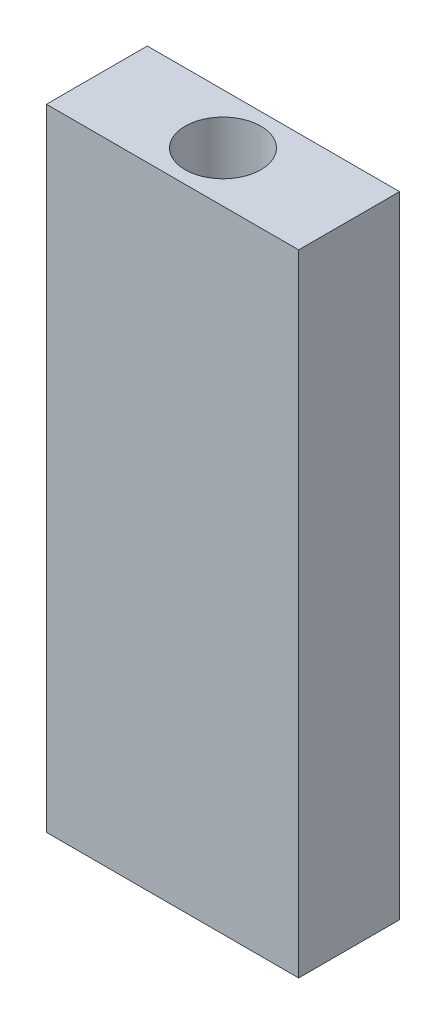
ISO-10303-21;
HEADER;
FILE_DESCRIPTION(('STEP AP214'),'2;1');
FILE_NAME('part.step','',(''),(''),'','','');
FILE_SCHEMA(('AUTOMOTIVE_DESIGN { 1 0 10303 214 1 1 1 1 }'));
ENDSEC;
DATA;
#1=APPLICATION_CONTEXT('core data for automotive mechanical design processes');
#2=APPLICATION_PROTOCOL_DEFINITION('international standard','automotive_design',2000,#1);
#3=PRODUCT_CONTEXT('',#1,'mechanical');
#4=PRODUCT('Part','Part','',(#3));
#5=PRODUCT_RELATED_PRODUCT_CATEGORY('part','',(#4));
#6=PRODUCT_DEFINITION_FORMATION('','',#4);
#7=PRODUCT_DEFINITION_CONTEXT('part definition',#1,'design');
#8=PRODUCT_DEFINITION('design','',#6,#7);
#9=PRODUCT_DEFINITION_SHAPE('','',#8);
#10=(LENGTH_UNIT() NAMED_UNIT(*) SI_UNIT(.MILLI.,.METRE.));
#11=(NAMED_UNIT(*) PLANE_ANGLE_UNIT() SI_UNIT($,.RADIAN.));
#12=(NAMED_UNIT(*) SI_UNIT($,.STERADIAN.) SOLID_ANGLE_UNIT());
#13=UNCERTAINTY_MEASURE_WITH_UNIT(LENGTH_MEASURE(1.E-05),#10,'distance_accuracy_value','');
#14=(GEOMETRIC_REPRESENTATION_CONTEXT(3) GLOBAL_UNCERTAINTY_ASSIGNED_CONTEXT((#13)) GLOBAL_UNIT_ASSIGNED_CONTEXT((#10,
#11,#12)) REPRESENTATION_CONTEXT('',''));
#15=CARTESIAN_POINT('',(0.,0.,0.));
#16=DIRECTION('',(0.,0.,1.));
#17=DIRECTION('',(1.,0.,0.));
#18=AXIS2_PLACEMENT_3D('',#15,#16,#17);
#19=CARTESIAN_POINT('',(0.,25.,0.));
#20=DIRECTION('',(0.,1.,0.));
#21=DIRECTION('',(0.,0.,1.));
#22=AXIS2_PLACEMENT_3D('',#19,#20,#21);
#23=PLANE('',#22);
#24=DIRECTION('',(0.,0.,1.));
#25=VECTOR('',#24,1.);
#26=CARTESIAN_POINT('',(-5.,25.,-2.));
#27=LINE('',#26,#25);
#28=CARTESIAN_POINT('',(-5.,25.,-2.));
#29=VERTEX_POINT('',#28);
#30=CARTESIAN_POINT('',(-5.,25.,2.));
#31=VERTEX_POINT('',#30);
#32=EDGE_CURVE('E109',#29,#31,#27,.T.);
#33=ORIENTED_EDGE('',*,*,#32,.T.);
#34=DIRECTION('',(1.,0.,0.));
#35=VECTOR('',#34,1.);
#36=CARTESIAN_POINT('',(-5.,25.,2.));
#37=LINE('',#36,#35);
#38=CARTESIAN_POINT('',(5.,25.,2.));
#39=VERTEX_POINT('',#38);
#40=EDGE_CURVE('E104',#31,#39,#37,.T.);
#41=ORIENTED_EDGE('',*,*,#40,.T.);
#42=DIRECTION('',(0.,0.,-1.));
#43=VECTOR('',#42,1.);
#44=CARTESIAN_POINT('',(5.,25.,-2.));
#45=LINE('',#44,#43);
#46=CARTESIAN_POINT('',(5.,25.,-2.));
#47=VERTEX_POINT('',#46);
#48=EDGE_CURVE('E107',#39,#47,#45,.T.);
#49=ORIENTED_EDGE('',*,*,#48,.T.);
#50=DIRECTION('',(-1.,0.,0.));
#51=VECTOR('',#50,1.);
#52=CARTESIAN_POINT('',(-5.,25.,-2.));
#53=LINE('',#52,#51);
#54=EDGE_CURVE('E68',#47,#29,#53,.T.);
#55=ORIENTED_EDGE('',*,*,#54,.T.);
#56=EDGE_LOOP('',(#33,#41,#49,#55));
#57=FACE_BOUND('',#56,.T.);
#58=CARTESIAN_POINT('',(0.,25.,0.));
#59=DIRECTION('',(0.,1.,0.));
#60=DIRECTION('',(0.,0.,1.));
#61=AXIS2_PLACEMENT_3D('',#58,#59,#60);
#62=CIRCLE('',#61,1.5);
#63=CARTESIAN_POINT('',(0.,25.,1.5));
#64=VERTEX_POINT('',#63);
#65=EDGE_CURVE('E130',#64,#64,#62,.T.);
#66=ORIENTED_EDGE('',*,*,#65,.F.);
#67=EDGE_LOOP('',(#66));
#68=FACE_BOUND('',#67,.T.);
#69=ADVANCED_FACE('F48',(#57,#68),#23,.T.);
#70=CARTESIAN_POINT('',(0.,0.,0.));
#71=DIRECTION('',(0.,1.,0.));
#72=DIRECTION('',(0.,0.,1.));
#73=AXIS2_PLACEMENT_3D('',#70,#71,#72);
#74=PLANE('',#73);
#75=DIRECTION('',(0.,0.,1.));
#76=VECTOR('',#75,1.);
#77=CARTESIAN_POINT('',(-5.,0.,-2.));
#78=LINE('',#77,#76);
#79=CARTESIAN_POINT('',(-5.,0.,-2.));
#80=VERTEX_POINT('',#79);
#81=CARTESIAN_POINT('',(-5.,0.,2.));
#82=VERTEX_POINT('',#81);
#83=EDGE_CURVE('E126',#80,#82,#78,.T.);
#84=ORIENTED_EDGE('',*,*,#83,.F.);
#85=DIRECTION('',(-1.,0.,0.));
#86=VECTOR('',#85,1.);
#87=CARTESIAN_POINT('',(-5.,0.,-2.));
#88=LINE('',#87,#86);
#89=CARTESIAN_POINT('',(5.,0.,-2.));
#90=VERTEX_POINT('',#89);
#91=EDGE_CURVE('E97',#90,#80,#88,.T.);
#92=ORIENTED_EDGE('',*,*,#91,.F.);
#93=DIRECTION('',(0.,0.,-1.));
#94=VECTOR('',#93,1.);
#95=CARTESIAN_POINT('',(5.,0.,-2.));
#96=LINE('',#95,#94);
#97=CARTESIAN_POINT('',(5.,0.,2.));
#98=VERTEX_POINT('',#97);
#99=EDGE_CURVE('E89',#98,#90,#96,.T.);
#100=ORIENTED_EDGE('',*,*,#99,.F.);
#101=DIRECTION('',(1.,0.,0.));
#102=VECTOR('',#101,1.);
#103=CARTESIAN_POINT('',(-5.,0.,2.));
#104=LINE('',#103,#102);
#105=EDGE_CURVE('E114',#82,#98,#104,.T.);
#106=ORIENTED_EDGE('',*,*,#105,.F.);
#107=EDGE_LOOP('',(#84,#92,#100,#106));
#108=FACE_BOUND('',#107,.T.);
#109=CARTESIAN_POINT('',(0.,0.,0.));
#110=DIRECTION('',(0.,1.,0.));
#111=DIRECTION('',(0.,0.,1.));
#112=AXIS2_PLACEMENT_3D('',#109,#110,#111);
#113=CIRCLE('',#112,1.5);
#114=CARTESIAN_POINT('',(0.,0.,1.5));
#115=VERTEX_POINT('',#114);
#116=EDGE_CURVE('E147',#115,#115,#113,.T.);
#117=ORIENTED_EDGE('',*,*,#116,.T.);
#118=EDGE_LOOP('',(#117));
#119=FACE_BOUND('',#118,.T.);
#120=ADVANCED_FACE('F142',(#108,#119),#74,.F.);
#121=CARTESIAN_POINT('',(-5.,25.,-2.));
#122=DIRECTION('',(1.,0.,0.));
#123=DIRECTION('',(0.,0.,-1.));
#124=AXIS2_PLACEMENT_3D('',#121,#122,#123);
#125=PLANE('',#124);
#126=ORIENTED_EDGE('',*,*,#83,.T.);
#127=DIRECTION('',(0.,-1.,0.));
#128=VECTOR('',#127,1.);
#129=CARTESIAN_POINT('',(-5.,25.,2.));
#130=LINE('',#129,#128);
#131=EDGE_CURVE('E13',#31,#82,#130,.T.);
#132=ORIENTED_EDGE('',*,*,#131,.F.);
#133=ORIENTED_EDGE('',*,*,#32,.F.);
#134=DIRECTION('',(0.,-1.,0.));
#135=VECTOR('',#134,1.);
#136=CARTESIAN_POINT('',(-5.,25.,-2.));
#137=LINE('',#136,#135);
#138=EDGE_CURVE('E122',#29,#80,#137,.T.);
#139=ORIENTED_EDGE('',*,*,#138,.T.);
#140=EDGE_LOOP('',(#126,#132,#133,#139));
#141=FACE_BOUND('',#140,.T.);
#142=ADVANCED_FACE('F50',(#141),#125,.F.);
#143=CARTESIAN_POINT('',(-5.,25.,2.));
#144=DIRECTION('',(0.,0.,-1.));
#145=DIRECTION('',(-1.,0.,0.));
#146=AXIS2_PLACEMENT_3D('',#143,#144,#145);
#147=PLANE('',#146);
#148=ORIENTED_EDGE('',*,*,#105,.T.);
#149=DIRECTION('',(0.,-1.,0.));
#150=VECTOR('',#149,1.);
#151=CARTESIAN_POINT('',(5.,25.,2.));
#152=LINE('',#151,#150);
#153=EDGE_CURVE('E58',#39,#98,#152,.T.);
#154=ORIENTED_EDGE('',*,*,#153,.F.);
#155=ORIENTED_EDGE('',*,*,#40,.F.);
#156=ORIENTED_EDGE('',*,*,#131,.T.);
#157=EDGE_LOOP('',(#148,#154,#155,#156));
#158=FACE_BOUND('',#157,.T.);
#159=ADVANCED_FACE('F113',(#158),#147,.F.);
#160=CARTESIAN_POINT('',(5.,25.,-2.));
#161=DIRECTION('',(-1.,0.,0.));
#162=DIRECTION('',(0.,0.,1.));
#163=AXIS2_PLACEMENT_3D('',#160,#161,#162);
#164=PLANE('',#163);
#165=ORIENTED_EDGE('',*,*,#99,.T.);
#166=DIRECTION('',(0.,-1.,0.));
#167=VECTOR('',#166,1.);
#168=CARTESIAN_POINT('',(5.,25.,-2.));
#169=LINE('',#168,#167);
#170=EDGE_CURVE('E116',#47,#90,#169,.T.);
#171=ORIENTED_EDGE('',*,*,#170,.F.);
#172=ORIENTED_EDGE('',*,*,#48,.F.);
#173=ORIENTED_EDGE('',*,*,#153,.T.);
#174=EDGE_LOOP('',(#165,#171,#172,#173));
#175=FACE_BOUND('',#174,.T.);
#176=ADVANCED_FACE('F117',(#175),#164,.F.);
#177=CARTESIAN_POINT('',(-5.,25.,-2.));
#178=DIRECTION('',(0.,0.,1.));
#179=DIRECTION('',(1.,0.,0.));
#180=AXIS2_PLACEMENT_3D('',#177,#178,#179);
#181=PLANE('',#180);
#182=ORIENTED_EDGE('',*,*,#91,.T.);
#183=ORIENTED_EDGE('',*,*,#138,.F.);
#184=ORIENTED_EDGE('',*,*,#54,.F.);
#185=ORIENTED_EDGE('',*,*,#170,.T.);
#186=EDGE_LOOP('',(#182,#183,#184,#185));
#187=FACE_BOUND('',#186,.T.);
#188=ADVANCED_FACE('F139',(#187),#181,.F.);
#189=CARTESIAN_POINT('',(0.,25.,0.));
#190=DIRECTION('',(0.,-1.,0.));
#191=DIRECTION('',(0.,0.,-1.));
#192=AXIS2_PLACEMENT_3D('',#189,#190,#191);
#193=CYLINDRICAL_SURFACE('',#192,1.5);
#194=ORIENTED_EDGE('',*,*,#65,.T.);
#195=EDGE_LOOP('',(#194));
#196=FACE_BOUND('',#195,.T.);
#197=ORIENTED_EDGE('',*,*,#116,.F.);
#198=EDGE_LOOP('',(#197));
#199=FACE_BOUND('',#198,.T.);
#200=ADVANCED_FACE('F155',(#196,#199),#193,.F.);
#201=CLOSED_SHELL('',(#69,#120,#142,#159,#176,#188,#200));
#202=MANIFOLD_SOLID_BREP('B2',#201);
#203=ADVANCED_BREP_SHAPE_REPRESENTATION('',(#18,#202),#14);
#204=SHAPE_DEFINITION_REPRESENTATION(#9,#203);
ENDSEC;
END-ISO-10303-21;
